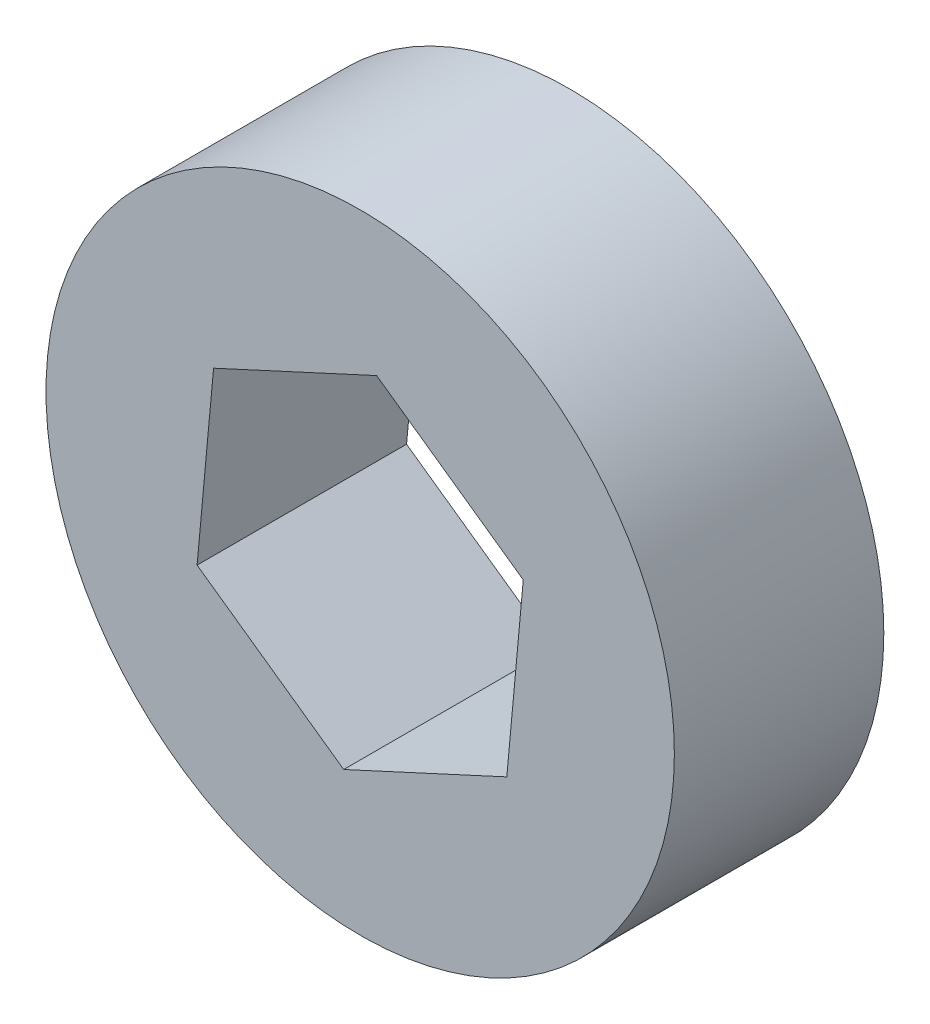
ISO-10303-21;
HEADER;
FILE_DESCRIPTION(('STEP AP214'),'2;1');
FILE_NAME('part.step','',(''),(''),'','','');
FILE_SCHEMA(('AUTOMOTIVE_DESIGN { 1 0 10303 214 1 1 1 1 }'));
ENDSEC;
DATA;
#1=APPLICATION_CONTEXT('core data for automotive mechanical design processes');
#2=APPLICATION_PROTOCOL_DEFINITION('international standard','automotive_design',2000,#1);
#3=PRODUCT_CONTEXT('',#1,'mechanical');
#4=PRODUCT('Part','Part','',(#3));
#5=PRODUCT_RELATED_PRODUCT_CATEGORY('part','',(#4));
#6=PRODUCT_DEFINITION_FORMATION('','',#4);
#7=PRODUCT_DEFINITION_CONTEXT('part definition',#1,'design');
#8=PRODUCT_DEFINITION('design','',#6,#7);
#9=PRODUCT_DEFINITION_SHAPE('','',#8);
#10=(LENGTH_UNIT() NAMED_UNIT(*) SI_UNIT(.MILLI.,.METRE.));
#11=(NAMED_UNIT(*) PLANE_ANGLE_UNIT() SI_UNIT($,.RADIAN.));
#12=(NAMED_UNIT(*) SI_UNIT($,.STERADIAN.) SOLID_ANGLE_UNIT());
#13=UNCERTAINTY_MEASURE_WITH_UNIT(LENGTH_MEASURE(1.E-05),#10,'distance_accuracy_value','');
#14=(GEOMETRIC_REPRESENTATION_CONTEXT(3) GLOBAL_UNCERTAINTY_ASSIGNED_CONTEXT((#13)) GLOBAL_UNIT_ASSIGNED_CONTEXT((#10,
#11,#12)) REPRESENTATION_CONTEXT('',''));
#15=CARTESIAN_POINT('',(0.,0.,0.));
#16=DIRECTION('',(0.,0.,1.));
#17=DIRECTION('',(1.,0.,0.));
#18=AXIS2_PLACEMENT_3D('',#15,#16,#17);
#19=CARTESIAN_POINT('',(0.,0.,5.));
#20=DIRECTION('',(0.,0.,1.));
#21=DIRECTION('',(1.,0.,0.));
#22=AXIS2_PLACEMENT_3D('',#19,#20,#21);
#23=PLANE('',#22);
#24=CARTESIAN_POINT('',(0.,0.,5.));
#25=DIRECTION('',(0.,0.,1.));
#26=DIRECTION('',(1.,0.,0.));
#27=AXIS2_PLACEMENT_3D('',#24,#25,#26);
#28=CIRCLE('',#27,7.5);
#29=CARTESIAN_POINT('',(7.5,0.,5.));
#30=VERTEX_POINT('',#29);
#31=EDGE_CURVE('E11',#30,#30,#28,.T.);
#32=ORIENTED_EDGE('',*,*,#31,.T.);
#33=EDGE_LOOP('',(#32));
#34=FACE_BOUND('',#33,.T.);
#35=DIRECTION('',(-0.908237393653462,-0.418455298412587,0.));
#36=VECTOR('',#35,1.);
#37=CARTESIAN_POINT('',(0.393185126889241,4.26845742317824,5.));
#38=LINE('',#37,#36);
#39=CARTESIAN_POINT('',(0.393185126889241,4.26845742317824,5.));
#40=VERTEX_POINT('',#39);
#41=CARTESIAN_POINT('',(-3.5,2.47473701986541,5.));
#42=VERTEX_POINT('',#41);
#43=EDGE_CURVE('E94',#40,#42,#38,.T.);
#44=ORIENTED_EDGE('',*,*,#43,.F.);
#45=DIRECTION('',(-0.816511615600229,0.577329006364572,0.));
#46=VECTOR('',#45,1.);
#47=CARTESIAN_POINT('',(3.89318512688924,1.79372040331283,5.));
#48=LINE('',#47,#46);
#49=CARTESIAN_POINT('',(3.89318512688924,1.79372040331283,5.));
#50=VERTEX_POINT('',#49);
#51=EDGE_CURVE('E86',#50,#40,#48,.T.);
#52=ORIENTED_EDGE('',*,*,#51,.F.);
#53=DIRECTION('',(0.0917257780532325,0.995784304777159,0.));
#54=VECTOR('',#53,1.);
#55=CARTESIAN_POINT('',(3.5,-2.47473701986541,5.));
#56=LINE('',#55,#54);
#57=CARTESIAN_POINT('',(3.5,-2.47473701986541,5.));
#58=VERTEX_POINT('',#57);
#59=EDGE_CURVE('E114',#58,#50,#56,.T.);
#60=ORIENTED_EDGE('',*,*,#59,.F.);
#61=DIRECTION('',(0.908237393653462,0.418455298412587,0.));
#62=VECTOR('',#61,1.);
#63=CARTESIAN_POINT('',(-0.393185126889238,-4.26845742317824,5.));
#64=LINE('',#63,#62);
#65=CARTESIAN_POINT('',(-0.393185126889238,-4.26845742317824,5.));
#66=VERTEX_POINT('',#65);
#67=EDGE_CURVE('E112',#66,#58,#64,.T.);
#68=ORIENTED_EDGE('',*,*,#67,.F.);
#69=DIRECTION('',(0.816511615600229,-0.577329006364572,0.));
#70=VECTOR('',#69,1.);
#71=CARTESIAN_POINT('',(-3.89318512688924,-1.79372040331283,5.));
#72=LINE('',#71,#70);
#73=CARTESIAN_POINT('',(-3.89318512688924,-1.79372040331283,5.));
#74=VERTEX_POINT('',#73);
#75=EDGE_CURVE('E108',#74,#66,#72,.T.);
#76=ORIENTED_EDGE('',*,*,#75,.F.);
#77=DIRECTION('',(-0.0917257780532324,-0.995784304777159,0.));
#78=VECTOR('',#77,1.);
#79=CARTESIAN_POINT('',(-3.5,2.47473701986541,5.));
#80=LINE('',#79,#78);
#81=EDGE_CURVE('E106',#42,#74,#80,.T.);
#82=ORIENTED_EDGE('',*,*,#81,.F.);
#83=EDGE_LOOP('',(#44,#52,#60,#68,#76,#82));
#84=FACE_BOUND('',#83,.T.);
#85=ADVANCED_FACE('F33',(#34,#84),#23,.T.);
#86=CARTESIAN_POINT('',(0.,0.,0.));
#87=DIRECTION('',(0.,0.,1.));
#88=DIRECTION('',(1.,0.,0.));
#89=AXIS2_PLACEMENT_3D('',#86,#87,#88);
#90=PLANE('',#89);
#91=CARTESIAN_POINT('',(0.,0.,0.));
#92=DIRECTION('',(0.,0.,1.));
#93=DIRECTION('',(1.,0.,0.));
#94=AXIS2_PLACEMENT_3D('',#91,#92,#93);
#95=CIRCLE('',#94,7.5);
#96=CARTESIAN_POINT('',(7.5,0.,0.));
#97=VERTEX_POINT('',#96);
#98=EDGE_CURVE('E37',#97,#97,#95,.T.);
#99=ORIENTED_EDGE('',*,*,#98,.F.);
#100=EDGE_LOOP('',(#99));
#101=FACE_BOUND('',#100,.T.);
#102=DIRECTION('',(-0.816511615600229,0.577329006364572,0.));
#103=VECTOR('',#102,1.);
#104=CARTESIAN_POINT('',(3.89318512688924,1.79372040331283,0.));
#105=LINE('',#104,#103);
#106=CARTESIAN_POINT('',(3.89318512688924,1.79372040331283,0.));
#107=VERTEX_POINT('',#106);
#108=CARTESIAN_POINT('',(0.393185126889241,4.26845742317824,0.));
#109=VERTEX_POINT('',#108);
#110=EDGE_CURVE('E56',#107,#109,#105,.T.);
#111=ORIENTED_EDGE('',*,*,#110,.T.);
#112=DIRECTION('',(-0.908237393653462,-0.418455298412587,0.));
#113=VECTOR('',#112,1.);
#114=CARTESIAN_POINT('',(0.393185126889241,4.26845742317824,0.));
#115=LINE('',#114,#113);
#116=CARTESIAN_POINT('',(-3.5,2.47473701986541,0.));
#117=VERTEX_POINT('',#116);
#118=EDGE_CURVE('E101',#109,#117,#115,.T.);
#119=ORIENTED_EDGE('',*,*,#118,.T.);
#120=DIRECTION('',(-0.0917257780532324,-0.995784304777159,0.));
#121=VECTOR('',#120,1.);
#122=CARTESIAN_POINT('',(-3.5,2.47473701986541,0.));
#123=LINE('',#122,#121);
#124=CARTESIAN_POINT('',(-3.89318512688924,-1.79372040331283,0.));
#125=VERTEX_POINT('',#124);
#126=EDGE_CURVE('E118',#117,#125,#123,.T.);
#127=ORIENTED_EDGE('',*,*,#126,.T.);
#128=DIRECTION('',(0.816511615600229,-0.577329006364572,0.));
#129=VECTOR('',#128,1.);
#130=CARTESIAN_POINT('',(-3.89318512688924,-1.79372040331283,0.));
#131=LINE('',#130,#129);
#132=CARTESIAN_POINT('',(-0.393185126889238,-4.26845742317824,0.));
#133=VERTEX_POINT('',#132);
#134=EDGE_CURVE('E121',#125,#133,#131,.T.);
#135=ORIENTED_EDGE('',*,*,#134,.T.);
#136=DIRECTION('',(0.908237393653462,0.418455298412587,0.));
#137=VECTOR('',#136,1.);
#138=CARTESIAN_POINT('',(-0.393185126889238,-4.26845742317824,0.));
#139=LINE('',#138,#137);
#140=CARTESIAN_POINT('',(3.5,-2.47473701986541,0.));
#141=VERTEX_POINT('',#140);
#142=EDGE_CURVE('E124',#133,#141,#139,.T.);
#143=ORIENTED_EDGE('',*,*,#142,.T.);
#144=DIRECTION('',(0.0917257780532325,0.995784304777159,0.));
#145=VECTOR('',#144,1.);
#146=CARTESIAN_POINT('',(3.5,-2.47473701986541,0.));
#147=LINE('',#146,#145);
#148=EDGE_CURVE('E95',#141,#107,#147,.T.);
#149=ORIENTED_EDGE('',*,*,#148,.T.);
#150=EDGE_LOOP('',(#111,#119,#127,#135,#143,#149));
#151=FACE_BOUND('',#150,.T.);
#152=ADVANCED_FACE('F141',(#101,#151),#90,.F.);
#153=CARTESIAN_POINT('',(0.,0.,5.));
#154=DIRECTION('',(0.,0.,-1.));
#155=DIRECTION('',(-1.,0.,0.));
#156=AXIS2_PLACEMENT_3D('',#153,#154,#155);
#157=CYLINDRICAL_SURFACE('',#156,7.5);
#158=ORIENTED_EDGE('',*,*,#31,.F.);
#159=EDGE_LOOP('',(#158));
#160=FACE_BOUND('',#159,.T.);
#161=ORIENTED_EDGE('',*,*,#98,.T.);
#162=EDGE_LOOP('',(#161));
#163=FACE_BOUND('',#162,.T.);
#164=ADVANCED_FACE('F35',(#160,#163),#157,.T.);
#165=CARTESIAN_POINT('',(3.89318512688924,1.79372040331283,5.));
#166=DIRECTION('',(-0.577329006364572,-0.816511615600229,0.));
#167=DIRECTION('',(0.816511615600229,-0.577329006364572,0.));
#168=AXIS2_PLACEMENT_3D('',#165,#166,#167);
#169=PLANE('',#168);
#170=ORIENTED_EDGE('',*,*,#110,.F.);
#171=DIRECTION('',(0.,0.,-1.));
#172=VECTOR('',#171,1.);
#173=CARTESIAN_POINT('',(3.89318512688924,1.79372040331283,5.));
#174=LINE('',#173,#172);
#175=EDGE_CURVE('E90',#50,#107,#174,.T.);
#176=ORIENTED_EDGE('',*,*,#175,.F.);
#177=ORIENTED_EDGE('',*,*,#51,.T.);
#178=DIRECTION('',(0.,0.,-1.));
#179=VECTOR('',#178,1.);
#180=CARTESIAN_POINT('',(0.393185126889241,4.26845742317824,5.));
#181=LINE('',#180,#179);
#182=EDGE_CURVE('E89',#40,#109,#181,.T.);
#183=ORIENTED_EDGE('',*,*,#182,.T.);
#184=EDGE_LOOP('',(#170,#176,#177,#183));
#185=FACE_BOUND('',#184,.T.);
#186=ADVANCED_FACE('F88',(#185),#169,.T.);
#187=CARTESIAN_POINT('',(0.393185126889241,4.26845742317824,5.));
#188=DIRECTION('',(0.418455298412587,-0.908237393653462,0.));
#189=DIRECTION('',(0.908237393653462,0.418455298412587,0.));
#190=AXIS2_PLACEMENT_3D('',#187,#188,#189);
#191=PLANE('',#190);
#192=ORIENTED_EDGE('',*,*,#118,.F.);
#193=ORIENTED_EDGE('',*,*,#182,.F.);
#194=ORIENTED_EDGE('',*,*,#43,.T.);
#195=DIRECTION('',(0.,0.,-1.));
#196=VECTOR('',#195,1.);
#197=CARTESIAN_POINT('',(-3.5,2.47473701986541,5.));
#198=LINE('',#197,#196);
#199=EDGE_CURVE('E102',#42,#117,#198,.T.);
#200=ORIENTED_EDGE('',*,*,#199,.T.);
#201=EDGE_LOOP('',(#192,#193,#194,#200));
#202=FACE_BOUND('',#201,.T.);
#203=ADVANCED_FACE('F98',(#202),#191,.T.);
#204=CARTESIAN_POINT('',(-3.5,2.47473701986541,5.));
#205=DIRECTION('',(0.995784304777159,-0.0917257780532324,0.));
#206=DIRECTION('',(0.0917257780532324,0.995784304777159,0.));
#207=AXIS2_PLACEMENT_3D('',#204,#205,#206);
#208=PLANE('',#207);
#209=ORIENTED_EDGE('',*,*,#126,.F.);
#210=ORIENTED_EDGE('',*,*,#199,.F.);
#211=ORIENTED_EDGE('',*,*,#81,.T.);
#212=DIRECTION('',(0.,0.,-1.));
#213=VECTOR('',#212,1.);
#214=CARTESIAN_POINT('',(-3.89318512688924,-1.79372040331283,5.));
#215=LINE('',#214,#213);
#216=EDGE_CURVE('E133',#74,#125,#215,.T.);
#217=ORIENTED_EDGE('',*,*,#216,.T.);
#218=EDGE_LOOP('',(#209,#210,#211,#217));
#219=FACE_BOUND('',#218,.T.);
#220=ADVANCED_FACE('F137',(#219),#208,.T.);
#221=CARTESIAN_POINT('',(-3.89318512688924,-1.79372040331283,5.));
#222=DIRECTION('',(0.577329006364572,0.816511615600229,0.));
#223=DIRECTION('',(-0.816511615600229,0.577329006364572,0.));
#224=AXIS2_PLACEMENT_3D('',#221,#222,#223);
#225=PLANE('',#224);
#226=ORIENTED_EDGE('',*,*,#134,.F.);
#227=ORIENTED_EDGE('',*,*,#216,.F.);
#228=ORIENTED_EDGE('',*,*,#75,.T.);
#229=DIRECTION('',(0.,0.,-1.));
#230=VECTOR('',#229,1.);
#231=CARTESIAN_POINT('',(-0.393185126889238,-4.26845742317824,5.));
#232=LINE('',#231,#230);
#233=EDGE_CURVE('E131',#66,#133,#232,.T.);
#234=ORIENTED_EDGE('',*,*,#233,.T.);
#235=EDGE_LOOP('',(#226,#227,#228,#234));
#236=FACE_BOUND('',#235,.T.);
#237=ADVANCED_FACE('F149',(#236),#225,.T.);
#238=CARTESIAN_POINT('',(-0.393185126889238,-4.26845742317824,5.));
#239=DIRECTION('',(-0.418455298412587,0.908237393653462,0.));
#240=DIRECTION('',(-0.908237393653462,-0.418455298412587,0.));
#241=AXIS2_PLACEMENT_3D('',#238,#239,#240);
#242=PLANE('',#241);
#243=ORIENTED_EDGE('',*,*,#142,.F.);
#244=ORIENTED_EDGE('',*,*,#233,.F.);
#245=ORIENTED_EDGE('',*,*,#67,.T.);
#246=DIRECTION('',(0.,0.,-1.));
#247=VECTOR('',#246,1.);
#248=CARTESIAN_POINT('',(3.5,-2.47473701986541,5.));
#249=LINE('',#248,#247);
#250=EDGE_CURVE('E48',#58,#141,#249,.T.);
#251=ORIENTED_EDGE('',*,*,#250,.T.);
#252=EDGE_LOOP('',(#243,#244,#245,#251));
#253=FACE_BOUND('',#252,.T.);
#254=ADVANCED_FACE('F147',(#253),#242,.T.);
#255=CARTESIAN_POINT('',(3.5,-2.47473701986541,5.));
#256=DIRECTION('',(-0.995784304777159,0.0917257780532324,0.));
#257=DIRECTION('',(-0.0917257780532324,-0.995784304777159,0.));
#258=AXIS2_PLACEMENT_3D('',#255,#256,#257);
#259=PLANE('',#258);
#260=ORIENTED_EDGE('',*,*,#148,.F.);
#261=ORIENTED_EDGE('',*,*,#250,.F.);
#262=ORIENTED_EDGE('',*,*,#59,.T.);
#263=ORIENTED_EDGE('',*,*,#175,.T.);
#264=EDGE_LOOP('',(#260,#261,#262,#263));
#265=FACE_BOUND('',#264,.T.);
#266=ADVANCED_FACE('F143',(#265),#259,.T.);
#267=CLOSED_SHELL('',(#85,#152,#164,#186,#203,#220,#237,#254,#266));
#268=MANIFOLD_SOLID_BREP('B2',#267);
#269=ADVANCED_BREP_SHAPE_REPRESENTATION('',(#18,#268),#14);
#270=SHAPE_DEFINITION_REPRESENTATION(#9,#269);
ENDSEC;
END-ISO-10303-21;
